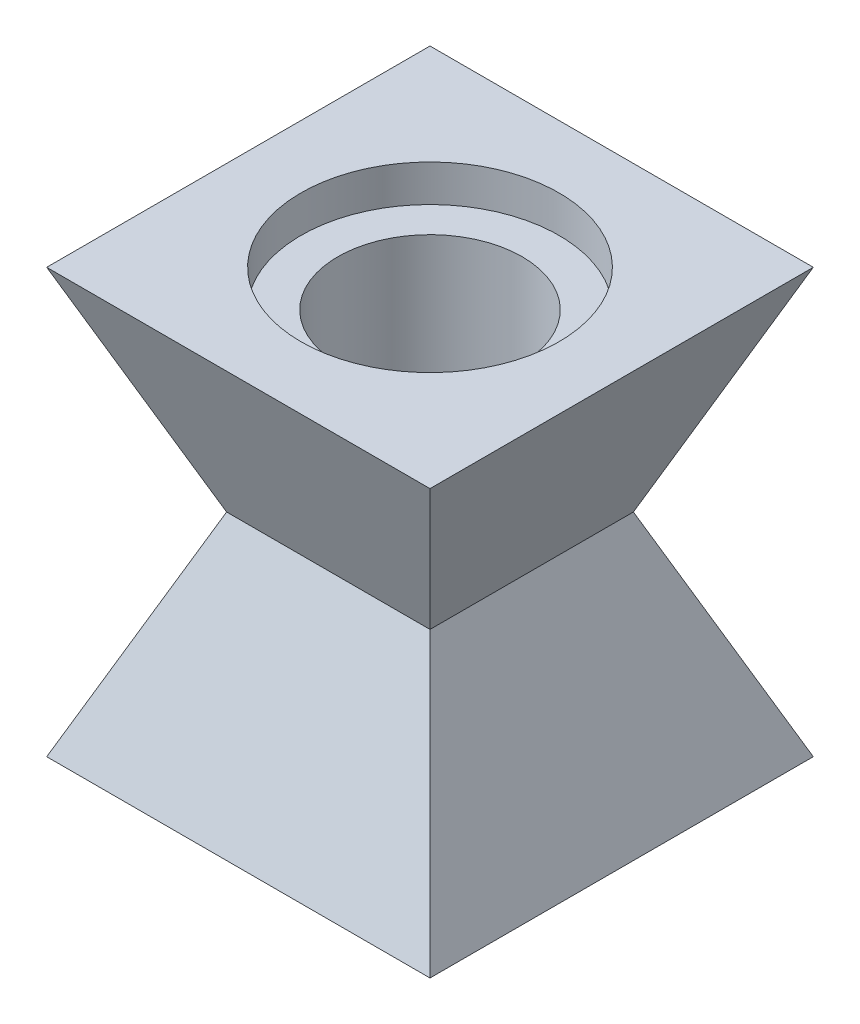
ISO-10303-21;
HEADER;
FILE_DESCRIPTION(('STEP AP214'),'2;1');
FILE_NAME('part.step','',(''),(''),'','','');
FILE_SCHEMA(('AUTOMOTIVE_DESIGN { 1 0 10303 214 1 1 1 1 }'));
ENDSEC;
DATA;
#1=APPLICATION_CONTEXT('core data for automotive mechanical design processes');
#2=APPLICATION_PROTOCOL_DEFINITION('international standard','automotive_design',2000,#1);
#3=PRODUCT_CONTEXT('',#1,'mechanical');
#4=PRODUCT('Part','Part','',(#3));
#5=PRODUCT_RELATED_PRODUCT_CATEGORY('part','',(#4));
#6=PRODUCT_DEFINITION_FORMATION('','',#4);
#7=PRODUCT_DEFINITION_CONTEXT('part definition',#1,'design');
#8=PRODUCT_DEFINITION('design','',#6,#7);
#9=PRODUCT_DEFINITION_SHAPE('','',#8);
#10=(LENGTH_UNIT() NAMED_UNIT(*) SI_UNIT(.MILLI.,.METRE.));
#11=(NAMED_UNIT(*) PLANE_ANGLE_UNIT() SI_UNIT($,.RADIAN.));
#12=(NAMED_UNIT(*) SI_UNIT($,.STERADIAN.) SOLID_ANGLE_UNIT());
#13=UNCERTAINTY_MEASURE_WITH_UNIT(LENGTH_MEASURE(1.E-05),#10,'distance_accuracy_value','');
#14=(GEOMETRIC_REPRESENTATION_CONTEXT(3) GLOBAL_UNCERTAINTY_ASSIGNED_CONTEXT((#13)) GLOBAL_UNIT_ASSIGNED_CONTEXT((#10,
#11,#12)) REPRESENTATION_CONTEXT('',''));
#15=CARTESIAN_POINT('',(0.,0.,0.));
#16=DIRECTION('',(0.,0.,1.));
#17=DIRECTION('',(1.,0.,0.));
#18=AXIS2_PLACEMENT_3D('',#15,#16,#17);
#19=CARTESIAN_POINT('',(0.,-57.5,0.));
#20=DIRECTION('',(0.,1.,0.));
#21=DIRECTION('',(0.,0.,1.));
#22=AXIS2_PLACEMENT_3D('',#19,#20,#21);
#23=CYLINDRICAL_SURFACE('',#22,25.);
#24=CARTESIAN_POINT('',(0.,-10.,0.));
#25=DIRECTION('',(0.,1.,0.));
#26=DIRECTION('',(0.,0.,1.));
#27=AXIS2_PLACEMENT_3D('',#24,#25,#26);
#28=CIRCLE('',#27,25.);
#29=CARTESIAN_POINT('',(0.,-10.,25.));
#30=VERTEX_POINT('',#29);
#31=EDGE_CURVE('E128',#30,#30,#28,.F.);
#32=ORIENTED_EDGE('',*,*,#31,.F.);
#33=EDGE_LOOP('',(#32));
#34=FACE_BOUND('',#33,.T.);
#35=CARTESIAN_POINT('',(0.,-105.,0.));
#36=DIRECTION('',(0.,-1.,0.));
#37=DIRECTION('',(0.,0.,-1.));
#38=AXIS2_PLACEMENT_3D('',#35,#36,#37);
#39=CIRCLE('',#38,25.);
#40=CARTESIAN_POINT('',(0.,-105.,-25.));
#41=VERTEX_POINT('',#40);
#42=EDGE_CURVE('E41',#41,#41,#39,.F.);
#43=ORIENTED_EDGE('',*,*,#42,.F.);
#44=EDGE_LOOP('',(#43));
#45=FACE_BOUND('',#44,.T.);
#46=ADVANCED_FACE('F37',(#34,#45),#23,.F.);
#47=CARTESIAN_POINT('',(-52.,0.,52.));
#48=DIRECTION('',(0.,-0.390731128489275,0.92050485345244));
#49=DIRECTION('',(0.,-0.92050485345244,-0.390731128489275));
#50=AXIS2_PLACEMENT_3D('',#47,#48,#49);
#51=PLANE('',#50);
#52=DIRECTION('',(1.,0.,0.));
#53=VECTOR('',#52,1.);
#54=CARTESIAN_POINT('',(-52.,0.,52.));
#55=LINE('',#54,#53);
#56=CARTESIAN_POINT('',(-52.,0.,52.));
#57=VERTEX_POINT('',#56);
#58=CARTESIAN_POINT('',(52.,0.,52.));
#59=VERTEX_POINT('',#58);
#60=EDGE_CURVE('E131',#57,#59,#55,.T.);
#61=ORIENTED_EDGE('',*,*,#60,.F.);
#62=DIRECTION('',(-0.363936289648103,0.8573801689766,0.363936289648103));
#63=VECTOR('',#62,1.);
#64=CARTESIAN_POINT('',(-38.2252392160259,-32.4513027815816,38.2252392160259));
#65=LINE('',#64,#63);
#66=CARTESIAN_POINT('',(-27.5926980679477,-57.5,27.5926980679476));
#67=VERTEX_POINT('',#66);
#68=EDGE_CURVE('E11',#67,#57,#65,.T.);
#69=ORIENTED_EDGE('',*,*,#68,.F.);
#70=DIRECTION('',(1.,0.,0.));
#71=VECTOR('',#70,1.);
#72=CARTESIAN_POINT('',(-52.,-57.5,27.5926980679476));
#73=LINE('',#72,#71);
#74=CARTESIAN_POINT('',(27.5926980679477,-57.5,27.5926980679476));
#75=VERTEX_POINT('',#74);
#76=EDGE_CURVE('E105',#67,#75,#73,.T.);
#77=ORIENTED_EDGE('',*,*,#76,.T.);
#78=DIRECTION('',(-0.363936289648103,-0.8573801689766,-0.363936289648103));
#79=VECTOR('',#78,1.);
#80=CARTESIAN_POINT('',(38.2252392160259,-32.4513027815816,38.2252392160258));
#81=LINE('',#80,#79);
#82=EDGE_CURVE('E142',#75,#59,#81,.F.);
#83=ORIENTED_EDGE('',*,*,#82,.T.);
#84=EDGE_LOOP('',(#61,#69,#77,#83));
#85=FACE_BOUND('',#84,.T.);
#86=ADVANCED_FACE('F163',(#85),#51,.T.);
#87=CARTESIAN_POINT('',(-52.,0.,-52.));
#88=DIRECTION('',(-0.92050485345244,-0.390731128489275,0.));
#89=DIRECTION('',(0.390731128489275,-0.92050485345244,0.));
#90=AXIS2_PLACEMENT_3D('',#87,#88,#89);
#91=PLANE('',#90);
#92=DIRECTION('',(0.,0.,1.));
#93=VECTOR('',#92,1.);
#94=CARTESIAN_POINT('',(-52.,0.,-52.));
#95=LINE('',#94,#93);
#96=CARTESIAN_POINT('',(-52.,0.,-52.));
#97=VERTEX_POINT('',#96);
#98=EDGE_CURVE('E139',#97,#57,#95,.T.);
#99=ORIENTED_EDGE('',*,*,#98,.F.);
#100=DIRECTION('',(0.363936289648103,-0.8573801689766,0.363936289648103));
#101=VECTOR('',#100,1.);
#102=CARTESIAN_POINT('',(-52.,0.,-52.));
#103=LINE('',#102,#101);
#104=CARTESIAN_POINT('',(-27.5926980679477,-57.5,-27.5926980679477));
#105=VERTEX_POINT('',#104);
#106=EDGE_CURVE('E47',#105,#97,#103,.F.);
#107=ORIENTED_EDGE('',*,*,#106,.F.);
#108=DIRECTION('',(0.,0.,1.));
#109=VECTOR('',#108,1.);
#110=CARTESIAN_POINT('',(-27.5926980679477,-57.5,-52.));
#111=LINE('',#110,#109);
#112=EDGE_CURVE('E145',#105,#67,#111,.T.);
#113=ORIENTED_EDGE('',*,*,#112,.T.);
#114=ORIENTED_EDGE('',*,*,#68,.T.);
#115=EDGE_LOOP('',(#99,#107,#113,#114));
#116=FACE_BOUND('',#115,.T.);
#117=ADVANCED_FACE('F39',(#116),#91,.T.);
#118=CARTESIAN_POINT('',(-52.,0.,-52.));
#119=DIRECTION('',(0.,-0.390731128489275,-0.92050485345244));
#120=DIRECTION('',(0.,0.92050485345244,-0.390731128489275));
#121=AXIS2_PLACEMENT_3D('',#118,#119,#120);
#122=PLANE('',#121);
#123=DIRECTION('',(1.,0.,0.));
#124=VECTOR('',#123,1.);
#125=CARTESIAN_POINT('',(-52.,0.,-52.));
#126=LINE('',#125,#124);
#127=CARTESIAN_POINT('',(52.,0.,-52.));
#128=VERTEX_POINT('',#127);
#129=EDGE_CURVE('E137',#97,#128,#126,.T.);
#130=ORIENTED_EDGE('',*,*,#129,.T.);
#131=DIRECTION('',(0.363936289648103,0.8573801689766,-0.363936289648103));
#132=VECTOR('',#131,1.);
#133=CARTESIAN_POINT('',(52.,0.,-52.));
#134=LINE('',#133,#132);
#135=CARTESIAN_POINT('',(27.5926980679477,-57.5,-27.5926980679477));
#136=VERTEX_POINT('',#135);
#137=EDGE_CURVE('E144',#136,#128,#134,.T.);
#138=ORIENTED_EDGE('',*,*,#137,.F.);
#139=DIRECTION('',(-1.,0.,0.));
#140=VECTOR('',#139,1.);
#141=CARTESIAN_POINT('',(-52.,-57.5,-27.5926980679477));
#142=LINE('',#141,#140);
#143=EDGE_CURVE('E152',#105,#136,#142,.F.);
#144=ORIENTED_EDGE('',*,*,#143,.F.);
#145=ORIENTED_EDGE('',*,*,#106,.T.);
#146=EDGE_LOOP('',(#130,#138,#144,#145));
#147=FACE_BOUND('',#146,.T.);
#148=ADVANCED_FACE('F209',(#147),#122,.T.);
#149=CARTESIAN_POINT('',(52.,0.,-52.));
#150=DIRECTION('',(0.92050485345244,-0.390731128489275,0.));
#151=DIRECTION('',(0.390731128489275,0.92050485345244,0.));
#152=AXIS2_PLACEMENT_3D('',#149,#150,#151);
#153=PLANE('',#152);
#154=DIRECTION('',(0.,0.,1.));
#155=VECTOR('',#154,1.);
#156=CARTESIAN_POINT('',(52.,0.,-52.));
#157=LINE('',#156,#155);
#158=EDGE_CURVE('E134',#128,#59,#157,.T.);
#159=ORIENTED_EDGE('',*,*,#158,.T.);
#160=ORIENTED_EDGE('',*,*,#82,.F.);
#161=DIRECTION('',(0.,0.,-1.));
#162=VECTOR('',#161,1.);
#163=CARTESIAN_POINT('',(27.5926980679477,-57.5,-52.));
#164=LINE('',#163,#162);
#165=EDGE_CURVE('E150',#136,#75,#164,.F.);
#166=ORIENTED_EDGE('',*,*,#165,.F.);
#167=ORIENTED_EDGE('',*,*,#137,.T.);
#168=EDGE_LOOP('',(#159,#160,#166,#167));
#169=FACE_BOUND('',#168,.T.);
#170=ADVANCED_FACE('F204',(#169),#153,.T.);
#171=CARTESIAN_POINT('',(0.,0.,0.));
#172=DIRECTION('',(0.,-1.,0.));
#173=DIRECTION('',(0.,0.,-1.));
#174=AXIS2_PLACEMENT_3D('',#171,#172,#173);
#175=PLANE('',#174);
#176=CARTESIAN_POINT('',(0.,0.,0.));
#177=DIRECTION('',(0.,1.,0.));
#178=DIRECTION('',(0.,0.,1.));
#179=AXIS2_PLACEMENT_3D('',#176,#177,#178);
#180=CIRCLE('',#179,35.);
#181=CARTESIAN_POINT('',(0.,0.,35.));
#182=VERTEX_POINT('',#181);
#183=EDGE_CURVE('E120',#182,#182,#180,.T.);
#184=ORIENTED_EDGE('',*,*,#183,.F.);
#185=EDGE_LOOP('',(#184));
#186=FACE_BOUND('',#185,.T.);
#187=ORIENTED_EDGE('',*,*,#60,.T.);
#188=ORIENTED_EDGE('',*,*,#158,.F.);
#189=ORIENTED_EDGE('',*,*,#129,.F.);
#190=ORIENTED_EDGE('',*,*,#98,.T.);
#191=EDGE_LOOP('',(#187,#188,#189,#190));
#192=FACE_BOUND('',#191,.T.);
#193=ADVANCED_FACE('F197',(#186,#192),#175,.F.);
#194=CARTESIAN_POINT('',(0.,-10.,0.));
#195=DIRECTION('',(0.,1.,0.));
#196=DIRECTION('',(0.,0.,1.));
#197=AXIS2_PLACEMENT_3D('',#194,#195,#196);
#198=PLANE('',#197);
#199=CARTESIAN_POINT('',(0.,-10.,0.));
#200=DIRECTION('',(0.,1.,0.));
#201=DIRECTION('',(0.,0.,1.));
#202=AXIS2_PLACEMENT_3D('',#199,#200,#201);
#203=CIRCLE('',#202,35.);
#204=CARTESIAN_POINT('',(0.,-10.,35.));
#205=VERTEX_POINT('',#204);
#206=EDGE_CURVE('E125',#205,#205,#203,.T.);
#207=ORIENTED_EDGE('',*,*,#206,.T.);
#208=EDGE_LOOP('',(#207));
#209=FACE_BOUND('',#208,.T.);
#210=ORIENTED_EDGE('',*,*,#31,.T.);
#211=EDGE_LOOP('',(#210));
#212=FACE_BOUND('',#211,.T.);
#213=ADVANCED_FACE('F159',(#209,#212),#198,.T.);
#214=CARTESIAN_POINT('',(0.,-10.,0.));
#215=DIRECTION('',(0.,1.,0.));
#216=DIRECTION('',(0.,0.,1.));
#217=AXIS2_PLACEMENT_3D('',#214,#215,#216);
#218=CYLINDRICAL_SURFACE('',#217,35.);
#219=ORIENTED_EDGE('',*,*,#206,.F.);
#220=EDGE_LOOP('',(#219));
#221=FACE_BOUND('',#220,.T.);
#222=ORIENTED_EDGE('',*,*,#183,.T.);
#223=EDGE_LOOP('',(#222));
#224=FACE_BOUND('',#223,.T.);
#225=ADVANCED_FACE('F185',(#221,#224),#218,.F.);
#226=CARTESIAN_POINT('',(-52.,-115.,52.));
#227=DIRECTION('',(0.,0.390731128489275,0.92050485345244));
#228=DIRECTION('',(0.,-0.92050485345244,0.390731128489275));
#229=AXIS2_PLACEMENT_3D('',#226,#227,#228);
#230=PLANE('',#229);
#231=DIRECTION('',(1.,0.,0.));
#232=VECTOR('',#231,1.);
#233=CARTESIAN_POINT('',(-52.,-115.,52.));
#234=LINE('',#233,#232);
#235=CARTESIAN_POINT('',(-52.,-115.,52.));
#236=VERTEX_POINT('',#235);
#237=CARTESIAN_POINT('',(52.,-115.,52.));
#238=VERTEX_POINT('',#237);
#239=EDGE_CURVE('E98',#236,#238,#234,.T.);
#240=ORIENTED_EDGE('',*,*,#239,.T.);
#241=DIRECTION('',(-0.363936289648103,0.8573801689766,-0.363936289648103));
#242=VECTOR('',#241,1.);
#243=CARTESIAN_POINT('',(38.2252392160259,-82.5486972184184,38.2252392160259));
#244=LINE('',#243,#242);
#245=EDGE_CURVE('E119',#75,#238,#244,.F.);
#246=ORIENTED_EDGE('',*,*,#245,.F.);
#247=ORIENTED_EDGE('',*,*,#76,.F.);
#248=DIRECTION('',(-0.363936289648103,-0.8573801689766,0.363936289648103));
#249=VECTOR('',#248,1.);
#250=CARTESIAN_POINT('',(-52.,-115.,52.));
#251=LINE('',#250,#249);
#252=EDGE_CURVE('E89',#67,#236,#251,.T.);
#253=ORIENTED_EDGE('',*,*,#252,.T.);
#254=EDGE_LOOP('',(#240,#246,#247,#253));
#255=FACE_BOUND('',#254,.T.);
#256=ADVANCED_FACE('F102',(#255),#230,.T.);
#257=CARTESIAN_POINT('',(52.,-115.,-52.));
#258=DIRECTION('',(0.92050485345244,0.390731128489275,0.));
#259=DIRECTION('',(-0.390731128489275,0.92050485345244,0.));
#260=AXIS2_PLACEMENT_3D('',#257,#258,#259);
#261=PLANE('',#260);
#262=DIRECTION('',(0.,0.,1.));
#263=VECTOR('',#262,1.);
#264=CARTESIAN_POINT('',(52.,-115.,-52.));
#265=LINE('',#264,#263);
#266=CARTESIAN_POINT('',(52.,-115.,-52.));
#267=VERTEX_POINT('',#266);
#268=EDGE_CURVE('E106',#267,#238,#265,.T.);
#269=ORIENTED_EDGE('',*,*,#268,.F.);
#270=DIRECTION('',(0.363936289648103,-0.8573801689766,-0.363936289648103));
#271=VECTOR('',#270,1.);
#272=CARTESIAN_POINT('',(38.2252392160259,-82.5486972184184,-38.2252392160259));
#273=LINE('',#272,#271);
#274=EDGE_CURVE('E121',#136,#267,#273,.T.);
#275=ORIENTED_EDGE('',*,*,#274,.F.);
#276=ORIENTED_EDGE('',*,*,#165,.T.);
#277=ORIENTED_EDGE('',*,*,#245,.T.);
#278=EDGE_LOOP('',(#269,#275,#276,#277));
#279=FACE_BOUND('',#278,.T.);
#280=ADVANCED_FACE('F184',(#279),#261,.T.);
#281=CARTESIAN_POINT('',(-52.,-115.,-52.));
#282=DIRECTION('',(0.,0.390731128489275,-0.92050485345244));
#283=DIRECTION('',(0.,0.92050485345244,0.390731128489275));
#284=AXIS2_PLACEMENT_3D('',#281,#282,#283);
#285=PLANE('',#284);
#286=DIRECTION('',(1.,0.,0.));
#287=VECTOR('',#286,1.);
#288=CARTESIAN_POINT('',(-52.,-115.,-52.));
#289=LINE('',#288,#287);
#290=CARTESIAN_POINT('',(-52.,-115.,-52.));
#291=VERTEX_POINT('',#290);
#292=EDGE_CURVE('E97',#291,#267,#289,.T.);
#293=ORIENTED_EDGE('',*,*,#292,.F.);
#294=DIRECTION('',(0.363936289648103,0.8573801689766,0.363936289648103));
#295=VECTOR('',#294,1.);
#296=CARTESIAN_POINT('',(-52.,-115.,-52.));
#297=LINE('',#296,#295);
#298=EDGE_CURVE('E92',#105,#291,#297,.F.);
#299=ORIENTED_EDGE('',*,*,#298,.F.);
#300=ORIENTED_EDGE('',*,*,#143,.T.);
#301=ORIENTED_EDGE('',*,*,#274,.T.);
#302=EDGE_LOOP('',(#293,#299,#300,#301));
#303=FACE_BOUND('',#302,.T.);
#304=ADVANCED_FACE('F188',(#303),#285,.T.);
#305=CARTESIAN_POINT('',(-52.,-115.,-52.));
#306=DIRECTION('',(-0.92050485345244,0.390731128489275,0.));
#307=DIRECTION('',(-0.390731128489275,-0.92050485345244,0.));
#308=AXIS2_PLACEMENT_3D('',#305,#306,#307);
#309=PLANE('',#308);
#310=DIRECTION('',(0.,0.,1.));
#311=VECTOR('',#310,1.);
#312=CARTESIAN_POINT('',(-52.,-115.,-52.));
#313=LINE('',#312,#311);
#314=EDGE_CURVE('E85',#291,#236,#313,.T.);
#315=ORIENTED_EDGE('',*,*,#314,.T.);
#316=ORIENTED_EDGE('',*,*,#252,.F.);
#317=ORIENTED_EDGE('',*,*,#112,.F.);
#318=ORIENTED_EDGE('',*,*,#298,.T.);
#319=EDGE_LOOP('',(#315,#316,#317,#318));
#320=FACE_BOUND('',#319,.T.);
#321=ADVANCED_FACE('F87',(#320),#309,.T.);
#322=CARTESIAN_POINT('',(0.,-115.,0.));
#323=DIRECTION('',(0.,1.,0.));
#324=DIRECTION('',(0.,0.,-1.));
#325=AXIS2_PLACEMENT_3D('',#322,#323,#324);
#326=PLANE('',#325);
#327=CARTESIAN_POINT('',(0.,-115.,0.));
#328=DIRECTION('',(0.,1.,0.));
#329=DIRECTION('',(0.,0.,1.));
#330=AXIS2_PLACEMENT_3D('',#327,#328,#329);
#331=CIRCLE('',#330,35.);
#332=CARTESIAN_POINT('',(0.,-115.,35.));
#333=VERTEX_POINT('',#332);
#334=EDGE_CURVE('E114',#333,#333,#331,.T.);
#335=ORIENTED_EDGE('',*,*,#334,.T.);
#336=EDGE_LOOP('',(#335));
#337=FACE_BOUND('',#336,.T.);
#338=ORIENTED_EDGE('',*,*,#239,.F.);
#339=ORIENTED_EDGE('',*,*,#314,.F.);
#340=ORIENTED_EDGE('',*,*,#292,.T.);
#341=ORIENTED_EDGE('',*,*,#268,.T.);
#342=EDGE_LOOP('',(#338,#339,#340,#341));
#343=FACE_BOUND('',#342,.T.);
#344=ADVANCED_FACE('F108',(#337,#343),#326,.F.);
#345=CARTESIAN_POINT('',(0.,-105.,0.));
#346=DIRECTION('',(0.,-1.,0.));
#347=DIRECTION('',(0.,0.,1.));
#348=AXIS2_PLACEMENT_3D('',#345,#346,#347);
#349=PLANE('',#348);
#350=CARTESIAN_POINT('',(0.,-105.,0.));
#351=DIRECTION('',(0.,1.,0.));
#352=DIRECTION('',(0.,0.,1.));
#353=AXIS2_PLACEMENT_3D('',#350,#351,#352);
#354=CIRCLE('',#353,35.);
#355=CARTESIAN_POINT('',(0.,-105.,35.));
#356=VERTEX_POINT('',#355);
#357=EDGE_CURVE('E112',#356,#356,#354,.T.);
#358=ORIENTED_EDGE('',*,*,#357,.F.);
#359=EDGE_LOOP('',(#358));
#360=FACE_BOUND('',#359,.T.);
#361=ORIENTED_EDGE('',*,*,#42,.T.);
#362=EDGE_LOOP('',(#361));
#363=FACE_BOUND('',#362,.T.);
#364=ADVANCED_FACE('F167',(#360,#363),#349,.T.);
#365=CARTESIAN_POINT('',(0.,-105.,0.));
#366=DIRECTION('',(0.,-1.,0.));
#367=DIRECTION('',(0.,0.,-1.));
#368=AXIS2_PLACEMENT_3D('',#365,#366,#367);
#369=CYLINDRICAL_SURFACE('',#368,35.);
#370=ORIENTED_EDGE('',*,*,#357,.T.);
#371=EDGE_LOOP('',(#370));
#372=FACE_BOUND('',#371,.T.);
#373=ORIENTED_EDGE('',*,*,#334,.F.);
#374=EDGE_LOOP('',(#373));
#375=FACE_BOUND('',#374,.T.);
#376=ADVANCED_FACE('F169',(#372,#375),#369,.F.);
#377=CLOSED_SHELL('',(#46,#86,#117,#148,#170,#193,#213,#225,#256,#280,#304,#321,#344,#364,#376));
#378=MANIFOLD_SOLID_BREP('B2',#377);
#379=ADVANCED_BREP_SHAPE_REPRESENTATION('',(#18,#378),#14);
#380=SHAPE_DEFINITION_REPRESENTATION(#9,#379);
ENDSEC;
END-ISO-10303-21;
